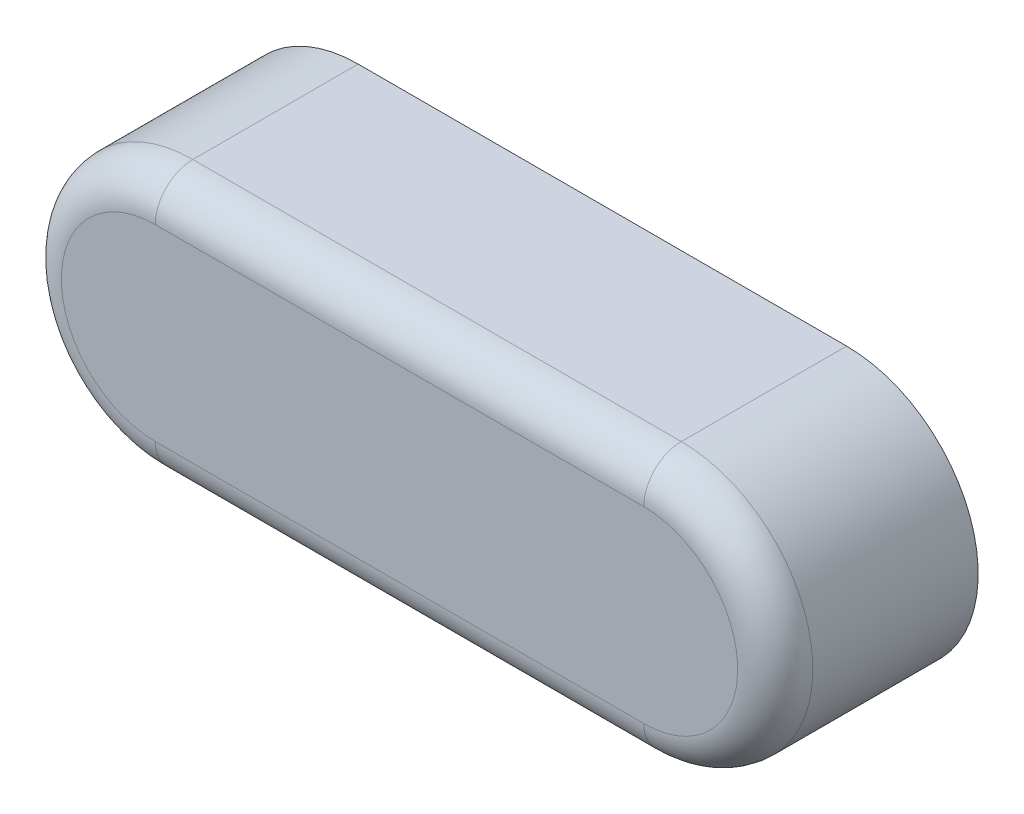
ISO-10303-21;
HEADER;
FILE_DESCRIPTION(('STEP AP214'),'2;1');
FILE_NAME('part.step','',(''),(''),'','','');
FILE_SCHEMA(('AUTOMOTIVE_DESIGN { 1 0 10303 214 1 1 1 1 }'));
ENDSEC;
DATA;
#1=APPLICATION_CONTEXT('core data for automotive mechanical design processes');
#2=APPLICATION_PROTOCOL_DEFINITION('international standard','automotive_design',2000,#1);
#3=PRODUCT_CONTEXT('',#1,'mechanical');
#4=PRODUCT('Part','Part','',(#3));
#5=PRODUCT_RELATED_PRODUCT_CATEGORY('part','',(#4));
#6=PRODUCT_DEFINITION_FORMATION('','',#4);
#7=PRODUCT_DEFINITION_CONTEXT('part definition',#1,'design');
#8=PRODUCT_DEFINITION('design','',#6,#7);
#9=PRODUCT_DEFINITION_SHAPE('','',#8);
#10=(LENGTH_UNIT() NAMED_UNIT(*) SI_UNIT(.MILLI.,.METRE.));
#11=(NAMED_UNIT(*) PLANE_ANGLE_UNIT() SI_UNIT($,.RADIAN.));
#12=(NAMED_UNIT(*) SI_UNIT($,.STERADIAN.) SOLID_ANGLE_UNIT());
#13=UNCERTAINTY_MEASURE_WITH_UNIT(LENGTH_MEASURE(1.E-05),#10,'distance_accuracy_value','');
#14=(GEOMETRIC_REPRESENTATION_CONTEXT(3) GLOBAL_UNCERTAINTY_ASSIGNED_CONTEXT((#13)) GLOBAL_UNIT_ASSIGNED_CONTEXT((#10,
#11,#12)) REPRESENTATION_CONTEXT('',''));
#15=CARTESIAN_POINT('',(0.,0.,0.));
#16=DIRECTION('',(0.,0.,1.));
#17=DIRECTION('',(1.,0.,0.));
#18=AXIS2_PLACEMENT_3D('',#15,#16,#17);
#19=CARTESIAN_POINT('',(-3.25,0.,2.7));
#20=DIRECTION('',(0.,0.,-1.));
#21=DIRECTION('',(-1.,0.,0.));
#22=AXIS2_PLACEMENT_3D('',#19,#20,#21);
#23=CYLINDRICAL_SURFACE('',#22,1.75);
#24=DIRECTION('',(0.,0.,-1.));
#25=VECTOR('',#24,1.);
#26=CARTESIAN_POINT('',(-3.25,-1.75,2.7));
#27=LINE('',#26,#25);
#28=CARTESIAN_POINT('',(-3.25,-1.75,2.2));
#29=VERTEX_POINT('',#28);
#30=CARTESIAN_POINT('',(-3.25,-1.75,0.));
#31=VERTEX_POINT('',#30);
#32=EDGE_CURVE('E84',#29,#31,#27,.T.);
#33=ORIENTED_EDGE('',*,*,#32,.F.);
#34=CARTESIAN_POINT('',(-3.25,0.,2.2));
#35=DIRECTION('',(0.,0.,1.));
#36=DIRECTION('',(1.,0.,0.));
#37=AXIS2_PLACEMENT_3D('',#34,#35,#36);
#38=CIRCLE('',#37,1.75);
#39=CARTESIAN_POINT('',(-3.25,1.75,2.2));
#40=VERTEX_POINT('',#39);
#41=EDGE_CURVE('E41',#29,#40,#38,.F.);
#42=ORIENTED_EDGE('',*,*,#41,.T.);
#43=DIRECTION('',(0.,0.,-1.));
#44=VECTOR('',#43,1.);
#45=CARTESIAN_POINT('',(-3.25,1.75,2.7));
#46=LINE('',#45,#44);
#47=CARTESIAN_POINT('',(-3.25,1.75,0.));
#48=VERTEX_POINT('',#47);
#49=EDGE_CURVE('E101',#40,#48,#46,.T.);
#50=ORIENTED_EDGE('',*,*,#49,.T.);
#51=CARTESIAN_POINT('',(-3.25,0.,0.));
#52=DIRECTION('',(0.,0.,1.));
#53=DIRECTION('',(1.,0.,0.));
#54=AXIS2_PLACEMENT_3D('',#51,#52,#53);
#55=CIRCLE('',#54,1.75);
#56=EDGE_CURVE('E97',#48,#31,#55,.T.);
#57=ORIENTED_EDGE('',*,*,#56,.T.);
#58=EDGE_LOOP('',(#33,#42,#50,#57));
#59=FACE_BOUND('',#58,.T.);
#60=ADVANCED_FACE('F32',(#59),#23,.T.);
#61=CARTESIAN_POINT('',(-3.25,-1.75,2.7));
#62=DIRECTION('',(0.,1.,0.));
#63=DIRECTION('',(0.,0.,1.));
#64=AXIS2_PLACEMENT_3D('',#61,#62,#63);
#65=PLANE('',#64);
#66=DIRECTION('',(0.,0.,-1.));
#67=VECTOR('',#66,1.);
#68=CARTESIAN_POINT('',(3.25,-1.75,2.7));
#69=LINE('',#68,#67);
#70=CARTESIAN_POINT('',(3.25,-1.75,2.2));
#71=VERTEX_POINT('',#70);
#72=CARTESIAN_POINT('',(3.25,-1.75,0.));
#73=VERTEX_POINT('',#72);
#74=EDGE_CURVE('E91',#71,#73,#69,.T.);
#75=ORIENTED_EDGE('',*,*,#74,.F.);
#76=DIRECTION('',(1.,0.,0.));
#77=VECTOR('',#76,1.);
#78=CARTESIAN_POINT('',(-3.25,-1.75,2.2));
#79=LINE('',#78,#77);
#80=EDGE_CURVE('E56',#71,#29,#79,.F.);
#81=ORIENTED_EDGE('',*,*,#80,.T.);
#82=ORIENTED_EDGE('',*,*,#32,.T.);
#83=DIRECTION('',(1.,0.,0.));
#84=VECTOR('',#83,1.);
#85=CARTESIAN_POINT('',(-3.25,-1.75,0.));
#86=LINE('',#85,#84);
#87=EDGE_CURVE('E87',#31,#73,#86,.T.);
#88=ORIENTED_EDGE('',*,*,#87,.T.);
#89=EDGE_LOOP('',(#75,#81,#82,#88));
#90=FACE_BOUND('',#89,.T.);
#91=ADVANCED_FACE('F86',(#90),#65,.F.);
#92=CARTESIAN_POINT('',(3.25,0.,2.7));
#93=DIRECTION('',(0.,0.,-1.));
#94=DIRECTION('',(-1.,0.,0.));
#95=AXIS2_PLACEMENT_3D('',#92,#93,#94);
#96=CYLINDRICAL_SURFACE('',#95,1.75);
#97=DIRECTION('',(0.,0.,-1.));
#98=VECTOR('',#97,1.);
#99=CARTESIAN_POINT('',(3.25,1.75,2.7));
#100=LINE('',#99,#98);
#101=CARTESIAN_POINT('',(3.25,1.75,2.2));
#102=VERTEX_POINT('',#101);
#103=CARTESIAN_POINT('',(3.25,1.75,0.));
#104=VERTEX_POINT('',#103);
#105=EDGE_CURVE('E111',#102,#104,#100,.T.);
#106=ORIENTED_EDGE('',*,*,#105,.F.);
#107=CARTESIAN_POINT('',(3.25,0.,2.2));
#108=DIRECTION('',(0.,0.,1.));
#109=DIRECTION('',(1.,0.,0.));
#110=AXIS2_PLACEMENT_3D('',#107,#108,#109);
#111=CIRCLE('',#110,1.75);
#112=EDGE_CURVE('E122',#102,#71,#111,.F.);
#113=ORIENTED_EDGE('',*,*,#112,.T.);
#114=ORIENTED_EDGE('',*,*,#74,.T.);
#115=CARTESIAN_POINT('',(3.25,0.,0.));
#116=DIRECTION('',(0.,0.,1.));
#117=DIRECTION('',(1.,0.,0.));
#118=AXIS2_PLACEMENT_3D('',#115,#116,#117);
#119=CIRCLE('',#118,1.75);
#120=EDGE_CURVE('E99',#73,#104,#119,.T.);
#121=ORIENTED_EDGE('',*,*,#120,.T.);
#122=EDGE_LOOP('',(#106,#113,#114,#121));
#123=FACE_BOUND('',#122,.T.);
#124=ADVANCED_FACE('F150',(#123),#96,.T.);
#125=CARTESIAN_POINT('',(-3.25,1.75,2.7));
#126=DIRECTION('',(0.,-1.,0.));
#127=DIRECTION('',(0.,0.,-1.));
#128=AXIS2_PLACEMENT_3D('',#125,#126,#127);
#129=PLANE('',#128);
#130=ORIENTED_EDGE('',*,*,#49,.F.);
#131=DIRECTION('',(-1.,0.,0.));
#132=VECTOR('',#131,1.);
#133=CARTESIAN_POINT('',(3.25,1.75,2.2));
#134=LINE('',#133,#132);
#135=EDGE_CURVE('E11',#40,#102,#134,.F.);
#136=ORIENTED_EDGE('',*,*,#135,.T.);
#137=ORIENTED_EDGE('',*,*,#105,.T.);
#138=DIRECTION('',(-1.,0.,0.));
#139=VECTOR('',#138,1.);
#140=CARTESIAN_POINT('',(-3.25,1.75,0.));
#141=LINE('',#140,#139);
#142=EDGE_CURVE('E108',#104,#48,#141,.T.);
#143=ORIENTED_EDGE('',*,*,#142,.T.);
#144=EDGE_LOOP('',(#130,#136,#137,#143));
#145=FACE_BOUND('',#144,.T.);
#146=ADVANCED_FACE('F152',(#145),#129,.F.);
#147=CARTESIAN_POINT('',(-3.25,0.,2.7));
#148=DIRECTION('',(0.,0.,1.));
#149=DIRECTION('',(1.,0.,0.));
#150=AXIS2_PLACEMENT_3D('',#147,#148,#149);
#151=PLANE('',#150);
#152=DIRECTION('',(1.,0.,0.));
#153=VECTOR('',#152,1.);
#154=CARTESIAN_POINT('',(3.25,-1.25,2.7));
#155=LINE('',#154,#153);
#156=CARTESIAN_POINT('',(-3.25,-1.25,2.7));
#157=VERTEX_POINT('',#156);
#158=CARTESIAN_POINT('',(3.25,-1.25,2.7));
#159=VERTEX_POINT('',#158);
#160=EDGE_CURVE('E117',#157,#159,#155,.T.);
#161=ORIENTED_EDGE('',*,*,#160,.T.);
#162=CARTESIAN_POINT('',(3.25,0.,2.7));
#163=DIRECTION('',(0.,0.,1.));
#164=DIRECTION('',(1.,0.,0.));
#165=AXIS2_PLACEMENT_3D('',#162,#163,#164);
#166=CIRCLE('',#165,1.25);
#167=CARTESIAN_POINT('',(3.25,1.25,2.7));
#168=VERTEX_POINT('',#167);
#169=EDGE_CURVE('E119',#159,#168,#166,.T.);
#170=ORIENTED_EDGE('',*,*,#169,.T.);
#171=DIRECTION('',(-1.,0.,0.));
#172=VECTOR('',#171,1.);
#173=CARTESIAN_POINT('',(-3.25,1.25,2.7));
#174=LINE('',#173,#172);
#175=CARTESIAN_POINT('',(-3.25,1.25,2.7));
#176=VERTEX_POINT('',#175);
#177=EDGE_CURVE('E90',#168,#176,#174,.T.);
#178=ORIENTED_EDGE('',*,*,#177,.T.);
#179=CARTESIAN_POINT('',(-3.25,0.,2.7));
#180=DIRECTION('',(0.,0.,1.));
#181=DIRECTION('',(1.,0.,0.));
#182=AXIS2_PLACEMENT_3D('',#179,#180,#181);
#183=CIRCLE('',#182,1.25);
#184=EDGE_CURVE('E115',#176,#157,#183,.T.);
#185=ORIENTED_EDGE('',*,*,#184,.T.);
#186=EDGE_LOOP('',(#161,#170,#178,#185));
#187=FACE_BOUND('',#186,.T.);
#188=ADVANCED_FACE('F142',(#187),#151,.T.);
#189=CARTESIAN_POINT('',(-3.25,0.,0.));
#190=DIRECTION('',(0.,0.,1.));
#191=DIRECTION('',(1.,0.,0.));
#192=AXIS2_PLACEMENT_3D('',#189,#190,#191);
#193=PLANE('',#192);
#194=ORIENTED_EDGE('',*,*,#56,.F.);
#195=ORIENTED_EDGE('',*,*,#142,.F.);
#196=ORIENTED_EDGE('',*,*,#120,.F.);
#197=ORIENTED_EDGE('',*,*,#87,.F.);
#198=EDGE_LOOP('',(#194,#195,#196,#197));
#199=FACE_BOUND('',#198,.T.);
#200=ADVANCED_FACE('F95',(#199),#193,.F.);
#201=CARTESIAN_POINT('',(-3.25,0.,2.2));
#202=DIRECTION('',(0.,0.,1.));
#203=DIRECTION('',(1.,0.,0.));
#204=AXIS2_PLACEMENT_3D('',#201,#202,#203);
#205=TOROIDAL_SURFACE('',#204,1.25,0.5);
#206=CARTESIAN_POINT('',(-3.25,1.25,2.2));
#207=DIRECTION('',(1.,0.,0.));
#208=DIRECTION('',(0.,0.,-1.));
#209=AXIS2_PLACEMENT_3D('',#206,#207,#208);
#210=CIRCLE('',#209,0.5);
#211=EDGE_CURVE('E105',#40,#176,#210,.T.);
#212=ORIENTED_EDGE('',*,*,#211,.F.);
#213=ORIENTED_EDGE('',*,*,#41,.F.);
#214=CARTESIAN_POINT('',(-3.25,-1.25,2.2));
#215=DIRECTION('',(1.,0.,0.));
#216=DIRECTION('',(0.,0.,-1.));
#217=AXIS2_PLACEMENT_3D('',#214,#215,#216);
#218=CIRCLE('',#217,0.5);
#219=EDGE_CURVE('E36',#157,#29,#218,.T.);
#220=ORIENTED_EDGE('',*,*,#219,.F.);
#221=ORIENTED_EDGE('',*,*,#184,.F.);
#222=EDGE_LOOP('',(#212,#213,#220,#221));
#223=FACE_BOUND('',#222,.T.);
#224=ADVANCED_FACE('F34',(#223),#205,.T.);
#225=CARTESIAN_POINT('',(-3.25,-1.25,2.2));
#226=DIRECTION('',(-1.,0.,0.));
#227=DIRECTION('',(0.,0.,1.));
#228=AXIS2_PLACEMENT_3D('',#225,#226,#227);
#229=CYLINDRICAL_SURFACE('',#228,0.5);
#230=ORIENTED_EDGE('',*,*,#219,.T.);
#231=ORIENTED_EDGE('',*,*,#80,.F.);
#232=CARTESIAN_POINT('',(3.25,-1.25,2.2));
#233=DIRECTION('',(1.,0.,0.));
#234=DIRECTION('',(0.,0.,-1.));
#235=AXIS2_PLACEMENT_3D('',#232,#233,#234);
#236=CIRCLE('',#235,0.5);
#237=EDGE_CURVE('E129',#159,#71,#236,.T.);
#238=ORIENTED_EDGE('',*,*,#237,.F.);
#239=ORIENTED_EDGE('',*,*,#160,.F.);
#240=EDGE_LOOP('',(#230,#231,#238,#239));
#241=FACE_BOUND('',#240,.T.);
#242=ADVANCED_FACE('F172',(#241),#229,.T.);
#243=CARTESIAN_POINT('',(-3.25,1.25,2.2));
#244=DIRECTION('',(1.,0.,0.));
#245=DIRECTION('',(0.,0.,-1.));
#246=AXIS2_PLACEMENT_3D('',#243,#244,#245);
#247=CYLINDRICAL_SURFACE('',#246,0.5);
#248=ORIENTED_EDGE('',*,*,#211,.T.);
#249=ORIENTED_EDGE('',*,*,#177,.F.);
#250=CARTESIAN_POINT('',(3.25,1.25,2.2));
#251=DIRECTION('',(1.,0.,0.));
#252=DIRECTION('',(0.,0.,-1.));
#253=AXIS2_PLACEMENT_3D('',#250,#251,#252);
#254=CIRCLE('',#253,0.5);
#255=EDGE_CURVE('E127',#102,#168,#254,.T.);
#256=ORIENTED_EDGE('',*,*,#255,.F.);
#257=ORIENTED_EDGE('',*,*,#135,.F.);
#258=EDGE_LOOP('',(#248,#249,#256,#257));
#259=FACE_BOUND('',#258,.T.);
#260=ADVANCED_FACE('F135',(#259),#247,.T.);
#261=CARTESIAN_POINT('',(3.25,0.,2.2));
#262=DIRECTION('',(0.,0.,1.));
#263=DIRECTION('',(1.,0.,0.));
#264=AXIS2_PLACEMENT_3D('',#261,#262,#263);
#265=TOROIDAL_SURFACE('',#264,1.25,0.5);
#266=ORIENTED_EDGE('',*,*,#237,.T.);
#267=ORIENTED_EDGE('',*,*,#112,.F.);
#268=ORIENTED_EDGE('',*,*,#255,.T.);
#269=ORIENTED_EDGE('',*,*,#169,.F.);
#270=EDGE_LOOP('',(#266,#267,#268,#269));
#271=FACE_BOUND('',#270,.T.);
#272=ADVANCED_FACE('F146',(#271),#265,.T.);
#273=CLOSED_SHELL('',(#60,#91,#124,#146,#188,#200,#224,#242,#260,#272));
#274=MANIFOLD_SOLID_BREP('B2',#273);
#275=ADVANCED_BREP_SHAPE_REPRESENTATION('',(#18,#274),#14);
#276=SHAPE_DEFINITION_REPRESENTATION(#9,#275);
ENDSEC;
END-ISO-10303-21;
